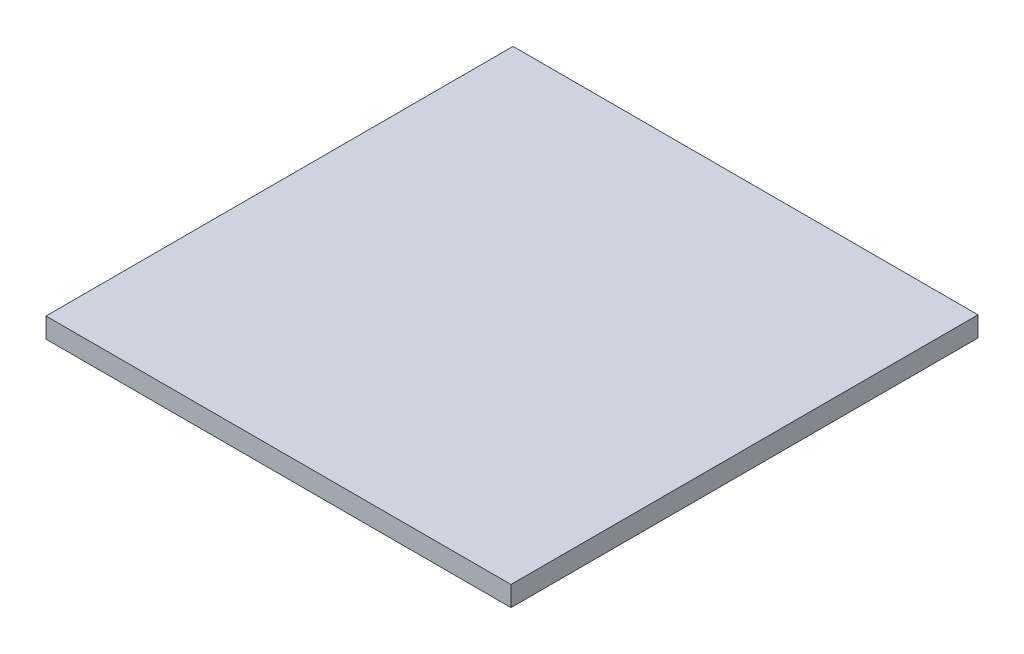
ISO-10303-21;
HEADER;
FILE_DESCRIPTION(('STEP AP214'),'2;1');
FILE_NAME('part.step','',(''),(''),'','','');
FILE_SCHEMA(('AUTOMOTIVE_DESIGN { 1 0 10303 214 1 1 1 1 }'));
ENDSEC;
DATA;
#1=APPLICATION_CONTEXT('core data for automotive mechanical design processes');
#2=APPLICATION_PROTOCOL_DEFINITION('international standard','automotive_design',2000,#1);
#3=PRODUCT_CONTEXT('',#1,'mechanical');
#4=PRODUCT('Part','Part','',(#3));
#5=PRODUCT_RELATED_PRODUCT_CATEGORY('part','',(#4));
#6=PRODUCT_DEFINITION_FORMATION('','',#4);
#7=PRODUCT_DEFINITION_CONTEXT('part definition',#1,'design');
#8=PRODUCT_DEFINITION('design','',#6,#7);
#9=PRODUCT_DEFINITION_SHAPE('','',#8);
#10=(LENGTH_UNIT() NAMED_UNIT(*) SI_UNIT(.MILLI.,.METRE.));
#11=(NAMED_UNIT(*) PLANE_ANGLE_UNIT() SI_UNIT($,.RADIAN.));
#12=(NAMED_UNIT(*) SI_UNIT($,.STERADIAN.) SOLID_ANGLE_UNIT());
#13=UNCERTAINTY_MEASURE_WITH_UNIT(LENGTH_MEASURE(1.E-05),#10,'distance_accuracy_value','');
#14=(GEOMETRIC_REPRESENTATION_CONTEXT(3) GLOBAL_UNCERTAINTY_ASSIGNED_CONTEXT((#13)) GLOBAL_UNIT_ASSIGNED_CONTEXT((#10,
#11,#12)) REPRESENTATION_CONTEXT('',''));
#15=CARTESIAN_POINT('',(0.,0.,0.));
#16=DIRECTION('',(0.,0.,1.));
#17=DIRECTION('',(1.,0.,0.));
#18=AXIS2_PLACEMENT_3D('',#15,#16,#17);
#19=CARTESIAN_POINT('',(0.,0.95,0.));
#20=DIRECTION('',(1.,0.,0.));
#21=DIRECTION('',(0.,0.,-1.));
#22=AXIS2_PLACEMENT_3D('',#19,#20,#21);
#23=PLANE('',#22);
#24=DIRECTION('',(0.,0.,1.));
#25=VECTOR('',#24,1.);
#26=CARTESIAN_POINT('',(0.,0.,0.));
#27=LINE('',#26,#25);
#28=CARTESIAN_POINT('',(0.,0.,-22.098));
#29=VERTEX_POINT('',#28);
#30=CARTESIAN_POINT('',(0.,0.,0.));
#31=VERTEX_POINT('',#30);
#32=EDGE_CURVE('E96',#29,#31,#27,.T.);
#33=ORIENTED_EDGE('',*,*,#32,.T.);
#34=DIRECTION('',(0.,-1.,0.));
#35=VECTOR('',#34,1.);
#36=CARTESIAN_POINT('',(0.,0.95,0.));
#37=LINE('',#36,#35);
#38=CARTESIAN_POINT('',(0.,0.95,0.));
#39=VERTEX_POINT('',#38);
#40=EDGE_CURVE('E11',#39,#31,#37,.T.);
#41=ORIENTED_EDGE('',*,*,#40,.F.);
#42=DIRECTION('',(0.,0.,1.));
#43=VECTOR('',#42,1.);
#44=CARTESIAN_POINT('',(0.,0.95,0.));
#45=LINE('',#44,#43);
#46=CARTESIAN_POINT('',(0.,0.95,-22.098));
#47=VERTEX_POINT('',#46);
#48=EDGE_CURVE('E84',#47,#39,#45,.T.);
#49=ORIENTED_EDGE('',*,*,#48,.F.);
#50=DIRECTION('',(0.,-1.,0.));
#51=VECTOR('',#50,1.);
#52=CARTESIAN_POINT('',(0.,0.95,-22.098));
#53=LINE('',#52,#51);
#54=EDGE_CURVE('E92',#47,#29,#53,.T.);
#55=ORIENTED_EDGE('',*,*,#54,.T.);
#56=EDGE_LOOP('',(#33,#41,#49,#55));
#57=FACE_BOUND('',#56,.T.);
#58=ADVANCED_FACE('F33',(#57),#23,.F.);
#59=CARTESIAN_POINT('',(0.,0.95,0.));
#60=DIRECTION('',(0.,0.,-1.));
#61=DIRECTION('',(-1.,0.,0.));
#62=AXIS2_PLACEMENT_3D('',#59,#60,#61);
#63=PLANE('',#62);
#64=DIRECTION('',(1.,0.,0.));
#65=VECTOR('',#64,1.);
#66=CARTESIAN_POINT('',(0.,0.,0.));
#67=LINE('',#66,#65);
#68=CARTESIAN_POINT('',(22.,0.,0.));
#69=VERTEX_POINT('',#68);
#70=EDGE_CURVE('E88',#31,#69,#67,.T.);
#71=ORIENTED_EDGE('',*,*,#70,.T.);
#72=DIRECTION('',(0.,-1.,0.));
#73=VECTOR('',#72,1.);
#74=CARTESIAN_POINT('',(22.,0.95,0.));
#75=LINE('',#74,#73);
#76=CARTESIAN_POINT('',(22.,0.95,0.));
#77=VERTEX_POINT('',#76);
#78=EDGE_CURVE('E41',#77,#69,#75,.T.);
#79=ORIENTED_EDGE('',*,*,#78,.F.);
#80=DIRECTION('',(1.,0.,0.));
#81=VECTOR('',#80,1.);
#82=CARTESIAN_POINT('',(0.,0.95,0.));
#83=LINE('',#82,#81);
#84=EDGE_CURVE('E79',#39,#77,#83,.T.);
#85=ORIENTED_EDGE('',*,*,#84,.F.);
#86=ORIENTED_EDGE('',*,*,#40,.T.);
#87=EDGE_LOOP('',(#71,#79,#85,#86));
#88=FACE_BOUND('',#87,.T.);
#89=ADVANCED_FACE('F87',(#88),#63,.F.);
#90=CARTESIAN_POINT('',(22.,0.95,0.));
#91=DIRECTION('',(-1.,0.,0.));
#92=DIRECTION('',(0.,0.,1.));
#93=AXIS2_PLACEMENT_3D('',#90,#91,#92);
#94=PLANE('',#93);
#95=DIRECTION('',(0.,0.,-1.));
#96=VECTOR('',#95,1.);
#97=CARTESIAN_POINT('',(22.,0.,0.));
#98=LINE('',#97,#96);
#99=CARTESIAN_POINT('',(22.,0.,-22.098));
#100=VERTEX_POINT('',#99);
#101=EDGE_CURVE('E66',#69,#100,#98,.T.);
#102=ORIENTED_EDGE('',*,*,#101,.T.);
#103=DIRECTION('',(0.,-1.,0.));
#104=VECTOR('',#103,1.);
#105=CARTESIAN_POINT('',(22.,0.95,-22.098));
#106=LINE('',#105,#104);
#107=CARTESIAN_POINT('',(22.,0.95,-22.098));
#108=VERTEX_POINT('',#107);
#109=EDGE_CURVE('E89',#108,#100,#106,.T.);
#110=ORIENTED_EDGE('',*,*,#109,.F.);
#111=DIRECTION('',(0.,0.,-1.));
#112=VECTOR('',#111,1.);
#113=CARTESIAN_POINT('',(22.,0.95,0.));
#114=LINE('',#113,#112);
#115=EDGE_CURVE('E82',#77,#108,#114,.T.);
#116=ORIENTED_EDGE('',*,*,#115,.F.);
#117=ORIENTED_EDGE('',*,*,#78,.T.);
#118=EDGE_LOOP('',(#102,#110,#116,#117));
#119=FACE_BOUND('',#118,.T.);
#120=ADVANCED_FACE('F90',(#119),#94,.F.);
#121=CARTESIAN_POINT('',(0.,0.95,-22.098));
#122=DIRECTION('',(0.,0.,1.));
#123=DIRECTION('',(1.,0.,0.));
#124=AXIS2_PLACEMENT_3D('',#121,#122,#123);
#125=PLANE('',#124);
#126=DIRECTION('',(-1.,0.,0.));
#127=VECTOR('',#126,1.);
#128=CARTESIAN_POINT('',(0.,0.,-22.098));
#129=LINE('',#128,#127);
#130=EDGE_CURVE('E72',#100,#29,#129,.T.);
#131=ORIENTED_EDGE('',*,*,#130,.T.);
#132=ORIENTED_EDGE('',*,*,#54,.F.);
#133=DIRECTION('',(-1.,0.,0.));
#134=VECTOR('',#133,1.);
#135=CARTESIAN_POINT('',(0.,0.95,-22.098));
#136=LINE('',#135,#134);
#137=EDGE_CURVE('E49',#108,#47,#136,.T.);
#138=ORIENTED_EDGE('',*,*,#137,.F.);
#139=ORIENTED_EDGE('',*,*,#109,.T.);
#140=EDGE_LOOP('',(#131,#132,#138,#139));
#141=FACE_BOUND('',#140,.T.);
#142=ADVANCED_FACE('F103',(#141),#125,.F.);
#143=CARTESIAN_POINT('',(0.,0.95,0.));
#144=DIRECTION('',(0.,-1.,0.));
#145=DIRECTION('',(0.,0.,-1.));
#146=AXIS2_PLACEMENT_3D('',#143,#144,#145);
#147=PLANE('',#146);
#148=ORIENTED_EDGE('',*,*,#48,.T.);
#149=ORIENTED_EDGE('',*,*,#84,.T.);
#150=ORIENTED_EDGE('',*,*,#115,.T.);
#151=ORIENTED_EDGE('',*,*,#137,.T.);
#152=EDGE_LOOP('',(#148,#149,#150,#151));
#153=FACE_BOUND('',#152,.T.);
#154=ADVANCED_FACE('F80',(#153),#147,.F.);
#155=CARTESIAN_POINT('',(0.,0.,0.));
#156=DIRECTION('',(0.,-1.,0.));
#157=DIRECTION('',(0.,0.,-1.));
#158=AXIS2_PLACEMENT_3D('',#155,#156,#157);
#159=PLANE('',#158);
#160=ORIENTED_EDGE('',*,*,#32,.F.);
#161=ORIENTED_EDGE('',*,*,#130,.F.);
#162=ORIENTED_EDGE('',*,*,#101,.F.);
#163=ORIENTED_EDGE('',*,*,#70,.F.);
#164=EDGE_LOOP('',(#160,#161,#162,#163));
#165=FACE_BOUND('',#164,.T.);
#166=ADVANCED_FACE('F106',(#165),#159,.T.);
#167=CLOSED_SHELL('',(#58,#89,#120,#142,#154,#166));
#168=MANIFOLD_SOLID_BREP('B2',#167);
#169=ADVANCED_BREP_SHAPE_REPRESENTATION('',(#18,#168),#14);
#170=SHAPE_DEFINITION_REPRESENTATION(#9,#169);
ENDSEC;
END-ISO-10303-21;
